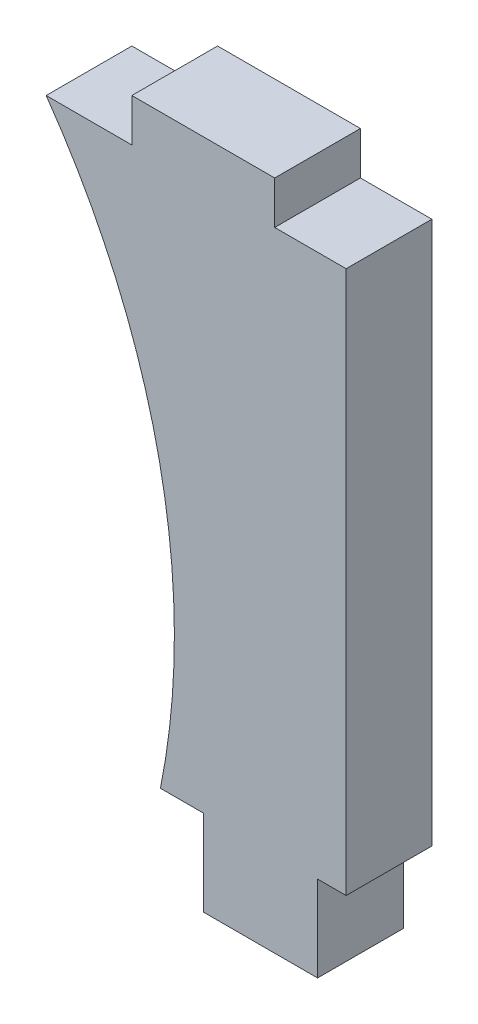
ISO-10303-21;
HEADER;
FILE_DESCRIPTION(('STEP AP214'),'2;1');
FILE_NAME('part.step','',(''),(''),'','','');
FILE_SCHEMA(('AUTOMOTIVE_DESIGN { 1 0 10303 214 1 1 1 1 }'));
ENDSEC;
DATA;
#1=APPLICATION_CONTEXT('core data for automotive mechanical design processes');
#2=APPLICATION_PROTOCOL_DEFINITION('international standard','automotive_design',2000,#1);
#3=PRODUCT_CONTEXT('',#1,'mechanical');
#4=PRODUCT('Part','Part','',(#3));
#5=PRODUCT_RELATED_PRODUCT_CATEGORY('part','',(#4));
#6=PRODUCT_DEFINITION_FORMATION('','',#4);
#7=PRODUCT_DEFINITION_CONTEXT('part definition',#1,'design');
#8=PRODUCT_DEFINITION('design','',#6,#7);
#9=PRODUCT_DEFINITION_SHAPE('','',#8);
#10=(LENGTH_UNIT() NAMED_UNIT(*) SI_UNIT(.MILLI.,.METRE.));
#11=(NAMED_UNIT(*) PLANE_ANGLE_UNIT() SI_UNIT($,.RADIAN.));
#12=(NAMED_UNIT(*) SI_UNIT($,.STERADIAN.) SOLID_ANGLE_UNIT());
#13=UNCERTAINTY_MEASURE_WITH_UNIT(LENGTH_MEASURE(1.E-05),#10,'distance_accuracy_value','');
#14=(GEOMETRIC_REPRESENTATION_CONTEXT(3) GLOBAL_UNCERTAINTY_ASSIGNED_CONTEXT((#13)) GLOBAL_UNIT_ASSIGNED_CONTEXT((#10,
#11,#12)) REPRESENTATION_CONTEXT('',''));
#15=CARTESIAN_POINT('',(0.,0.,0.));
#16=DIRECTION('',(0.,0.,1.));
#17=DIRECTION('',(1.,0.,0.));
#18=AXIS2_PLACEMENT_3D('',#15,#16,#17);
#19=CARTESIAN_POINT('',(-25.5119331031827,4.86590882038258,3.));
#20=DIRECTION('',(0.,0.,-1.));
#21=DIRECTION('',(-1.,0.,0.));
#22=AXIS2_PLACEMENT_3D('',#19,#20,#21);
#23=CYLINDRICAL_SURFACE('',#22,24.5);
#24=CARTESIAN_POINT('',(-25.5119331031827,4.86590882038258,0.));
#25=DIRECTION('',(0.,0.,-1.));
#26=DIRECTION('',(-1.,0.,0.));
#27=AXIS2_PLACEMENT_3D('',#24,#25,#26);
#28=CIRCLE('',#27,24.5);
#29=CARTESIAN_POINT('',(-5.5,19.,0.));
#30=VERTEX_POINT('',#29);
#31=CARTESIAN_POINT('',(-1.5,0.,0.));
#32=VERTEX_POINT('',#31);
#33=EDGE_CURVE('E154',#30,#32,#28,.T.);
#34=ORIENTED_EDGE('',*,*,#33,.T.);
#35=DIRECTION('',(0.,0.,-1.));
#36=VECTOR('',#35,1.);
#37=CARTESIAN_POINT('',(-1.5,0.,3.));
#38=LINE('',#37,#36);
#39=CARTESIAN_POINT('',(-1.5,0.,3.));
#40=VERTEX_POINT('',#39);
#41=EDGE_CURVE('E11',#40,#32,#38,.T.);
#42=ORIENTED_EDGE('',*,*,#41,.F.);
#43=CARTESIAN_POINT('',(-25.5119331031827,4.86590882038258,3.));
#44=DIRECTION('',(0.,0.,-1.));
#45=DIRECTION('',(-1.,0.,0.));
#46=AXIS2_PLACEMENT_3D('',#43,#44,#45);
#47=CIRCLE('',#46,24.5);
#48=CARTESIAN_POINT('',(-5.5,19.,3.));
#49=VERTEX_POINT('',#48);
#50=EDGE_CURVE('E176',#49,#40,#47,.T.);
#51=ORIENTED_EDGE('',*,*,#50,.F.);
#52=DIRECTION('',(0.,0.,-1.));
#53=VECTOR('',#52,1.);
#54=CARTESIAN_POINT('',(-5.5,19.,3.));
#55=LINE('',#54,#53);
#56=EDGE_CURVE('E150',#49,#30,#55,.T.);
#57=ORIENTED_EDGE('',*,*,#56,.T.);
#58=EDGE_LOOP('',(#34,#42,#51,#57));
#59=FACE_BOUND('',#58,.T.);
#60=ADVANCED_FACE('F34',(#59),#23,.F.);
#61=CARTESIAN_POINT('',(-1.5,0.,3.));
#62=DIRECTION('',(0.,1.,0.));
#63=DIRECTION('',(0.,0.,1.));
#64=AXIS2_PLACEMENT_3D('',#61,#62,#63);
#65=PLANE('',#64);
#66=DIRECTION('',(1.,0.,0.));
#67=VECTOR('',#66,1.);
#68=CARTESIAN_POINT('',(-1.5,0.,0.));
#69=LINE('',#68,#67);
#70=CARTESIAN_POINT('',(0.,0.,0.));
#71=VERTEX_POINT('',#70);
#72=EDGE_CURVE('E157',#32,#71,#69,.T.);
#73=ORIENTED_EDGE('',*,*,#72,.T.);
#74=DIRECTION('',(0.,0.,-1.));
#75=VECTOR('',#74,1.);
#76=CARTESIAN_POINT('',(0.,0.,3.));
#77=LINE('',#76,#75);
#78=CARTESIAN_POINT('',(0.,0.,3.));
#79=VERTEX_POINT('',#78);
#80=EDGE_CURVE('E42',#79,#71,#77,.T.);
#81=ORIENTED_EDGE('',*,*,#80,.F.);
#82=DIRECTION('',(1.,0.,0.));
#83=VECTOR('',#82,1.);
#84=CARTESIAN_POINT('',(-1.5,0.,3.));
#85=LINE('',#84,#83);
#86=EDGE_CURVE('E105',#40,#79,#85,.T.);
#87=ORIENTED_EDGE('',*,*,#86,.F.);
#88=ORIENTED_EDGE('',*,*,#41,.T.);
#89=EDGE_LOOP('',(#73,#81,#87,#88));
#90=FACE_BOUND('',#89,.T.);
#91=ADVANCED_FACE('F254',(#90),#65,.F.);
#92=CARTESIAN_POINT('',(0.,0.,3.));
#93=DIRECTION('',(1.,0.,0.));
#94=DIRECTION('',(0.,1.,0.));
#95=AXIS2_PLACEMENT_3D('',#92,#93,#94);
#96=PLANE('',#95);
#97=DIRECTION('',(0.,-1.,0.));
#98=VECTOR('',#97,1.);
#99=CARTESIAN_POINT('',(0.,0.,0.));
#100=LINE('',#99,#98);
#101=CARTESIAN_POINT('',(0.,-3.,0.));
#102=VERTEX_POINT('',#101);
#103=EDGE_CURVE('E159',#71,#102,#100,.T.);
#104=ORIENTED_EDGE('',*,*,#103,.T.);
#105=DIRECTION('',(0.,0.,-1.));
#106=VECTOR('',#105,1.);
#107=CARTESIAN_POINT('',(0.,-3.,3.));
#108=LINE('',#107,#106);
#109=CARTESIAN_POINT('',(0.,-3.,3.));
#110=VERTEX_POINT('',#109);
#111=EDGE_CURVE('E195',#110,#102,#108,.T.);
#112=ORIENTED_EDGE('',*,*,#111,.F.);
#113=DIRECTION('',(0.,-1.,0.));
#114=VECTOR('',#113,1.);
#115=CARTESIAN_POINT('',(0.,0.,3.));
#116=LINE('',#115,#114);
#117=EDGE_CURVE('E203',#79,#110,#116,.T.);
#118=ORIENTED_EDGE('',*,*,#117,.F.);
#119=ORIENTED_EDGE('',*,*,#80,.T.);
#120=EDGE_LOOP('',(#104,#112,#118,#119));
#121=FACE_BOUND('',#120,.T.);
#122=ADVANCED_FACE('F201',(#121),#96,.F.);
#123=CARTESIAN_POINT('',(0.,-3.,3.));
#124=DIRECTION('',(0.,1.,0.));
#125=DIRECTION('',(0.,0.,1.));
#126=AXIS2_PLACEMENT_3D('',#123,#124,#125);
#127=PLANE('',#126);
#128=DIRECTION('',(1.,0.,0.));
#129=VECTOR('',#128,1.);
#130=CARTESIAN_POINT('',(0.,-3.,0.));
#131=LINE('',#130,#129);
#132=CARTESIAN_POINT('',(4.,-3.,0.));
#133=VERTEX_POINT('',#132);
#134=EDGE_CURVE('E161',#102,#133,#131,.T.);
#135=ORIENTED_EDGE('',*,*,#134,.T.);
#136=DIRECTION('',(0.,0.,-1.));
#137=VECTOR('',#136,1.);
#138=CARTESIAN_POINT('',(4.,-3.,3.));
#139=LINE('',#138,#137);
#140=CARTESIAN_POINT('',(4.,-3.,3.));
#141=VERTEX_POINT('',#140);
#142=EDGE_CURVE('E192',#141,#133,#139,.T.);
#143=ORIENTED_EDGE('',*,*,#142,.F.);
#144=DIRECTION('',(1.,0.,0.));
#145=VECTOR('',#144,1.);
#146=CARTESIAN_POINT('',(0.,-3.,3.));
#147=LINE('',#146,#145);
#148=EDGE_CURVE('E221',#110,#141,#147,.T.);
#149=ORIENTED_EDGE('',*,*,#148,.F.);
#150=ORIENTED_EDGE('',*,*,#111,.T.);
#151=EDGE_LOOP('',(#135,#143,#149,#150));
#152=FACE_BOUND('',#151,.T.);
#153=ADVANCED_FACE('F212',(#152),#127,.F.);
#154=CARTESIAN_POINT('',(4.,-3.,3.));
#155=DIRECTION('',(-1.,0.,0.));
#156=DIRECTION('',(0.,0.,1.));
#157=AXIS2_PLACEMENT_3D('',#154,#155,#156);
#158=PLANE('',#157);
#159=DIRECTION('',(0.,1.,0.));
#160=VECTOR('',#159,1.);
#161=CARTESIAN_POINT('',(4.,-3.,0.));
#162=LINE('',#161,#160);
#163=CARTESIAN_POINT('',(4.,0.,0.));
#164=VERTEX_POINT('',#163);
#165=EDGE_CURVE('E163',#133,#164,#162,.T.);
#166=ORIENTED_EDGE('',*,*,#165,.T.);
#167=DIRECTION('',(0.,0.,-1.));
#168=VECTOR('',#167,1.);
#169=CARTESIAN_POINT('',(4.,0.,3.));
#170=LINE('',#169,#168);
#171=CARTESIAN_POINT('',(4.,0.,3.));
#172=VERTEX_POINT('',#171);
#173=EDGE_CURVE('E189',#172,#164,#170,.T.);
#174=ORIENTED_EDGE('',*,*,#173,.F.);
#175=DIRECTION('',(0.,1.,0.));
#176=VECTOR('',#175,1.);
#177=CARTESIAN_POINT('',(4.,-3.,3.));
#178=LINE('',#177,#176);
#179=EDGE_CURVE('E218',#141,#172,#178,.T.);
#180=ORIENTED_EDGE('',*,*,#179,.F.);
#181=ORIENTED_EDGE('',*,*,#142,.T.);
#182=EDGE_LOOP('',(#166,#174,#180,#181));
#183=FACE_BOUND('',#182,.T.);
#184=ADVANCED_FACE('F216',(#183),#158,.F.);
#185=CARTESIAN_POINT('',(4.,0.,3.));
#186=DIRECTION('',(0.,1.,0.));
#187=DIRECTION('',(-1.,0.,0.));
#188=AXIS2_PLACEMENT_3D('',#185,#186,#187);
#189=PLANE('',#188);
#190=DIRECTION('',(1.,0.,0.));
#191=VECTOR('',#190,1.);
#192=CARTESIAN_POINT('',(4.,0.,0.));
#193=LINE('',#192,#191);
#194=CARTESIAN_POINT('',(5.,0.,0.));
#195=VERTEX_POINT('',#194);
#196=EDGE_CURVE('E165',#164,#195,#193,.T.);
#197=ORIENTED_EDGE('',*,*,#196,.T.);
#198=DIRECTION('',(0.,0.,-1.));
#199=VECTOR('',#198,1.);
#200=CARTESIAN_POINT('',(5.,0.,3.));
#201=LINE('',#200,#199);
#202=CARTESIAN_POINT('',(5.,0.,3.));
#203=VERTEX_POINT('',#202);
#204=EDGE_CURVE('E186',#203,#195,#201,.T.);
#205=ORIENTED_EDGE('',*,*,#204,.F.);
#206=DIRECTION('',(1.,0.,0.));
#207=VECTOR('',#206,1.);
#208=CARTESIAN_POINT('',(4.,0.,3.));
#209=LINE('',#208,#207);
#210=EDGE_CURVE('E220',#172,#203,#209,.T.);
#211=ORIENTED_EDGE('',*,*,#210,.F.);
#212=ORIENTED_EDGE('',*,*,#173,.T.);
#213=EDGE_LOOP('',(#197,#205,#211,#212));
#214=FACE_BOUND('',#213,.T.);
#215=ADVANCED_FACE('F267',(#214),#189,.F.);
#216=CARTESIAN_POINT('',(5.,0.,3.));
#217=DIRECTION('',(-1.,0.,0.));
#218=DIRECTION('',(0.,0.,1.));
#219=AXIS2_PLACEMENT_3D('',#216,#217,#218);
#220=PLANE('',#219);
#221=DIRECTION('',(0.,1.,0.));
#222=VECTOR('',#221,1.);
#223=CARTESIAN_POINT('',(5.,0.,0.));
#224=LINE('',#223,#222);
#225=CARTESIAN_POINT('',(5.,19.,0.));
#226=VERTEX_POINT('',#225);
#227=EDGE_CURVE('E167',#195,#226,#224,.T.);
#228=ORIENTED_EDGE('',*,*,#227,.T.);
#229=DIRECTION('',(0.,0.,-1.));
#230=VECTOR('',#229,1.);
#231=CARTESIAN_POINT('',(5.,19.,3.));
#232=LINE('',#231,#230);
#233=CARTESIAN_POINT('',(5.,19.,3.));
#234=VERTEX_POINT('',#233);
#235=EDGE_CURVE('E183',#234,#226,#232,.T.);
#236=ORIENTED_EDGE('',*,*,#235,.F.);
#237=DIRECTION('',(0.,1.,0.));
#238=VECTOR('',#237,1.);
#239=CARTESIAN_POINT('',(5.,0.,3.));
#240=LINE('',#239,#238);
#241=EDGE_CURVE('E223',#203,#234,#240,.T.);
#242=ORIENTED_EDGE('',*,*,#241,.F.);
#243=ORIENTED_EDGE('',*,*,#204,.T.);
#244=EDGE_LOOP('',(#228,#236,#242,#243));
#245=FACE_BOUND('',#244,.T.);
#246=ADVANCED_FACE('F270',(#245),#220,.F.);
#247=CARTESIAN_POINT('',(5.,19.,3.));
#248=DIRECTION('',(0.,-1.,0.));
#249=DIRECTION('',(0.,0.,-1.));
#250=AXIS2_PLACEMENT_3D('',#247,#248,#249);
#251=PLANE('',#250);
#252=DIRECTION('',(-1.,0.,0.));
#253=VECTOR('',#252,1.);
#254=CARTESIAN_POINT('',(5.,19.,0.));
#255=LINE('',#254,#253);
#256=CARTESIAN_POINT('',(2.5,19.,0.));
#257=VERTEX_POINT('',#256);
#258=EDGE_CURVE('E169',#226,#257,#255,.T.);
#259=ORIENTED_EDGE('',*,*,#258,.T.);
#260=DIRECTION('',(0.,0.,-1.));
#261=VECTOR('',#260,1.);
#262=CARTESIAN_POINT('',(2.5,19.,3.));
#263=LINE('',#262,#261);
#264=CARTESIAN_POINT('',(2.5,19.,3.));
#265=VERTEX_POINT('',#264);
#266=EDGE_CURVE('E180',#265,#257,#263,.T.);
#267=ORIENTED_EDGE('',*,*,#266,.F.);
#268=DIRECTION('',(-1.,0.,0.));
#269=VECTOR('',#268,1.);
#270=CARTESIAN_POINT('',(5.,19.,3.));
#271=LINE('',#270,#269);
#272=EDGE_CURVE('E229',#234,#265,#271,.T.);
#273=ORIENTED_EDGE('',*,*,#272,.F.);
#274=ORIENTED_EDGE('',*,*,#235,.T.);
#275=EDGE_LOOP('',(#259,#267,#273,#274));
#276=FACE_BOUND('',#275,.T.);
#277=ADVANCED_FACE('F235',(#276),#251,.F.);
#278=CARTESIAN_POINT('',(2.5,19.,3.));
#279=DIRECTION('',(-1.,0.,0.));
#280=DIRECTION('',(0.,-1.,0.));
#281=AXIS2_PLACEMENT_3D('',#278,#279,#280);
#282=PLANE('',#281);
#283=DIRECTION('',(0.,1.,0.));
#284=VECTOR('',#283,1.);
#285=CARTESIAN_POINT('',(2.5,19.,0.));
#286=LINE('',#285,#284);
#287=CARTESIAN_POINT('',(2.5,20.5,0.));
#288=VERTEX_POINT('',#287);
#289=EDGE_CURVE('E171',#257,#288,#286,.T.);
#290=ORIENTED_EDGE('',*,*,#289,.T.);
#291=DIRECTION('',(0.,0.,-1.));
#292=VECTOR('',#291,1.);
#293=CARTESIAN_POINT('',(2.5,20.5,3.));
#294=LINE('',#293,#292);
#295=CARTESIAN_POINT('',(2.5,20.5,3.));
#296=VERTEX_POINT('',#295);
#297=EDGE_CURVE('E145',#296,#288,#294,.T.);
#298=ORIENTED_EDGE('',*,*,#297,.F.);
#299=DIRECTION('',(0.,1.,0.));
#300=VECTOR('',#299,1.);
#301=CARTESIAN_POINT('',(2.5,19.,3.));
#302=LINE('',#301,#300);
#303=EDGE_CURVE('E136',#265,#296,#302,.T.);
#304=ORIENTED_EDGE('',*,*,#303,.F.);
#305=ORIENTED_EDGE('',*,*,#266,.T.);
#306=EDGE_LOOP('',(#290,#298,#304,#305));
#307=FACE_BOUND('',#306,.T.);
#308=ADVANCED_FACE('F239',(#307),#282,.F.);
#309=CARTESIAN_POINT('',(2.5,20.5,3.));
#310=DIRECTION('',(0.,-1.,0.));
#311=DIRECTION('',(0.,0.,-1.));
#312=AXIS2_PLACEMENT_3D('',#309,#310,#311);
#313=PLANE('',#312);
#314=DIRECTION('',(-1.,0.,0.));
#315=VECTOR('',#314,1.);
#316=CARTESIAN_POINT('',(2.5,20.5,0.));
#317=LINE('',#316,#315);
#318=CARTESIAN_POINT('',(-2.5,20.5,0.));
#319=VERTEX_POINT('',#318);
#320=EDGE_CURVE('E144',#288,#319,#317,.T.);
#321=ORIENTED_EDGE('',*,*,#320,.T.);
#322=DIRECTION('',(0.,0.,-1.));
#323=VECTOR('',#322,1.);
#324=CARTESIAN_POINT('',(-2.5,20.5,3.));
#325=LINE('',#324,#323);
#326=CARTESIAN_POINT('',(-2.5,20.5,3.));
#327=VERTEX_POINT('',#326);
#328=EDGE_CURVE('E141',#327,#319,#325,.T.);
#329=ORIENTED_EDGE('',*,*,#328,.F.);
#330=DIRECTION('',(-1.,0.,0.));
#331=VECTOR('',#330,1.);
#332=CARTESIAN_POINT('',(2.5,20.5,3.));
#333=LINE('',#332,#331);
#334=EDGE_CURVE('E130',#296,#327,#333,.T.);
#335=ORIENTED_EDGE('',*,*,#334,.F.);
#336=ORIENTED_EDGE('',*,*,#297,.T.);
#337=EDGE_LOOP('',(#321,#329,#335,#336));
#338=FACE_BOUND('',#337,.T.);
#339=ADVANCED_FACE('F142',(#338),#313,.F.);
#340=CARTESIAN_POINT('',(-2.5,20.5,3.));
#341=DIRECTION('',(1.,0.,0.));
#342=DIRECTION('',(0.,1.,0.));
#343=AXIS2_PLACEMENT_3D('',#340,#341,#342);
#344=PLANE('',#343);
#345=DIRECTION('',(0.,-1.,0.));
#346=VECTOR('',#345,1.);
#347=CARTESIAN_POINT('',(-2.5,20.5,0.));
#348=LINE('',#347,#346);
#349=CARTESIAN_POINT('',(-2.5,19.,0.));
#350=VERTEX_POINT('',#349);
#351=EDGE_CURVE('E91',#319,#350,#348,.T.);
#352=ORIENTED_EDGE('',*,*,#351,.T.);
#353=DIRECTION('',(0.,0.,-1.));
#354=VECTOR('',#353,1.);
#355=CARTESIAN_POINT('',(-2.5,19.,3.));
#356=LINE('',#355,#354);
#357=CARTESIAN_POINT('',(-2.5,19.,3.));
#358=VERTEX_POINT('',#357);
#359=EDGE_CURVE('E146',#358,#350,#356,.T.);
#360=ORIENTED_EDGE('',*,*,#359,.F.);
#361=DIRECTION('',(0.,-1.,0.));
#362=VECTOR('',#361,1.);
#363=CARTESIAN_POINT('',(-2.5,20.5,3.));
#364=LINE('',#363,#362);
#365=EDGE_CURVE('E134',#327,#358,#364,.T.);
#366=ORIENTED_EDGE('',*,*,#365,.F.);
#367=ORIENTED_EDGE('',*,*,#328,.T.);
#368=EDGE_LOOP('',(#352,#360,#366,#367));
#369=FACE_BOUND('',#368,.T.);
#370=ADVANCED_FACE('F148',(#369),#344,.F.);
#371=CARTESIAN_POINT('',(-2.5,19.,3.));
#372=DIRECTION('',(0.,-1.,0.));
#373=DIRECTION('',(1.,0.,0.));
#374=AXIS2_PLACEMENT_3D('',#371,#372,#373);
#375=PLANE('',#374);
#376=DIRECTION('',(-1.,0.,0.));
#377=VECTOR('',#376,1.);
#378=CARTESIAN_POINT('',(-2.5,19.,0.));
#379=LINE('',#378,#377);
#380=EDGE_CURVE('E97',#350,#30,#379,.T.);
#381=ORIENTED_EDGE('',*,*,#380,.T.);
#382=ORIENTED_EDGE('',*,*,#56,.F.);
#383=DIRECTION('',(-1.,0.,0.));
#384=VECTOR('',#383,1.);
#385=CARTESIAN_POINT('',(-2.5,19.,3.));
#386=LINE('',#385,#384);
#387=EDGE_CURVE('E50',#358,#49,#386,.T.);
#388=ORIENTED_EDGE('',*,*,#387,.F.);
#389=ORIENTED_EDGE('',*,*,#359,.T.);
#390=EDGE_LOOP('',(#381,#382,#388,#389));
#391=FACE_BOUND('',#390,.T.);
#392=ADVANCED_FACE('F243',(#391),#375,.F.);
#393=CARTESIAN_POINT('',(-25.5119331031827,4.86590882038258,3.));
#394=DIRECTION('',(0.,0.,-1.));
#395=DIRECTION('',(-1.,0.,0.));
#396=AXIS2_PLACEMENT_3D('',#393,#394,#395);
#397=PLANE('',#396);
#398=ORIENTED_EDGE('',*,*,#50,.T.);
#399=ORIENTED_EDGE('',*,*,#86,.T.);
#400=ORIENTED_EDGE('',*,*,#117,.T.);
#401=ORIENTED_EDGE('',*,*,#148,.T.);
#402=ORIENTED_EDGE('',*,*,#179,.T.);
#403=ORIENTED_EDGE('',*,*,#210,.T.);
#404=ORIENTED_EDGE('',*,*,#241,.T.);
#405=ORIENTED_EDGE('',*,*,#272,.T.);
#406=ORIENTED_EDGE('',*,*,#303,.T.);
#407=ORIENTED_EDGE('',*,*,#334,.T.);
#408=ORIENTED_EDGE('',*,*,#365,.T.);
#409=ORIENTED_EDGE('',*,*,#387,.T.);
#410=EDGE_LOOP('',(#398,#399,#400,#401,#402,#403,#404,#405,#406,#407,#408,#409));
#411=FACE_BOUND('',#410,.T.);
#412=ADVANCED_FACE('F132',(#411),#397,.F.);
#413=CARTESIAN_POINT('',(-25.5119331031827,4.86590882038258,0.));
#414=DIRECTION('',(0.,0.,-1.));
#415=DIRECTION('',(-1.,0.,0.));
#416=AXIS2_PLACEMENT_3D('',#413,#414,#415);
#417=PLANE('',#416);
#418=ORIENTED_EDGE('',*,*,#33,.F.);
#419=ORIENTED_EDGE('',*,*,#380,.F.);
#420=ORIENTED_EDGE('',*,*,#351,.F.);
#421=ORIENTED_EDGE('',*,*,#320,.F.);
#422=ORIENTED_EDGE('',*,*,#289,.F.);
#423=ORIENTED_EDGE('',*,*,#258,.F.);
#424=ORIENTED_EDGE('',*,*,#227,.F.);
#425=ORIENTED_EDGE('',*,*,#196,.F.);
#426=ORIENTED_EDGE('',*,*,#165,.F.);
#427=ORIENTED_EDGE('',*,*,#134,.F.);
#428=ORIENTED_EDGE('',*,*,#103,.F.);
#429=ORIENTED_EDGE('',*,*,#72,.F.);
#430=EDGE_LOOP('',(#418,#419,#420,#421,#422,#423,#424,#425,#426,#427,#428,#429));
#431=FACE_BOUND('',#430,.T.);
#432=ADVANCED_FACE('F207',(#431),#417,.T.);
#433=CLOSED_SHELL('',(#60,#91,#122,#153,#184,#215,#246,#277,#308,#339,#370,#392,#412,#432));
#434=MANIFOLD_SOLID_BREP('B2',#433);
#435=ADVANCED_BREP_SHAPE_REPRESENTATION('',(#18,#434),#14);
#436=SHAPE_DEFINITION_REPRESENTATION(#9,#435);
ENDSEC;
END-ISO-10303-21;
